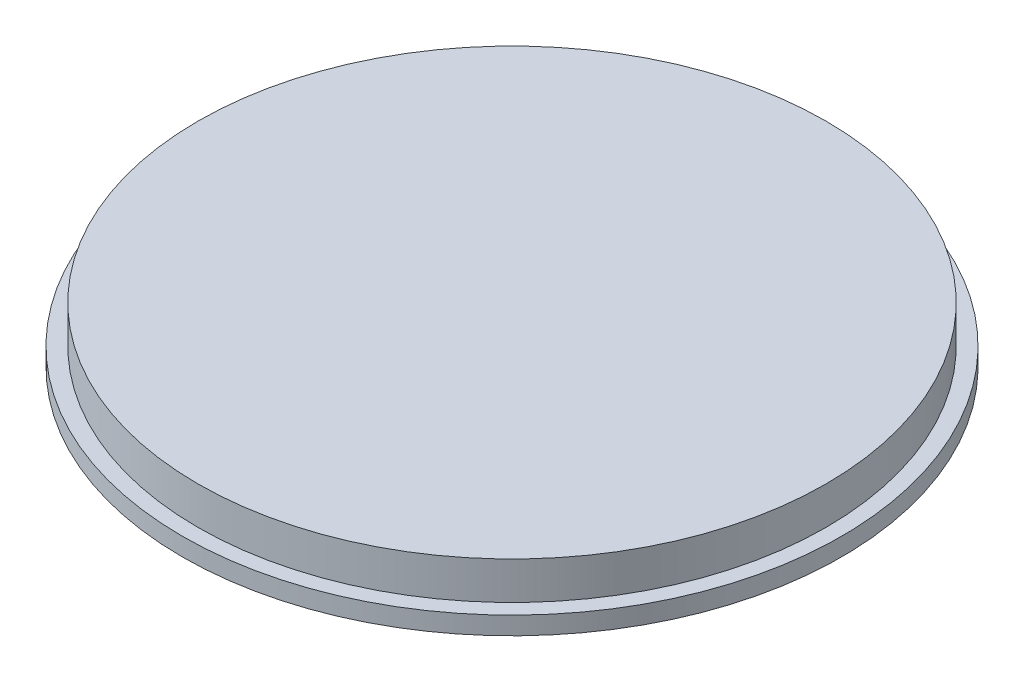
ISO-10303-21;
HEADER;
FILE_DESCRIPTION(('STEP AP214'),'2;1');
FILE_NAME('part.step','',(''),(''),'','','');
FILE_SCHEMA(('AUTOMOTIVE_DESIGN { 1 0 10303 214 1 1 1 1 }'));
ENDSEC;
DATA;
#1=APPLICATION_CONTEXT('core data for automotive mechanical design processes');
#2=APPLICATION_PROTOCOL_DEFINITION('international standard','automotive_design',2000,#1);
#3=PRODUCT_CONTEXT('',#1,'mechanical');
#4=PRODUCT('Part','Part','',(#3));
#5=PRODUCT_RELATED_PRODUCT_CATEGORY('part','',(#4));
#6=PRODUCT_DEFINITION_FORMATION('','',#4);
#7=PRODUCT_DEFINITION_CONTEXT('part definition',#1,'design');
#8=PRODUCT_DEFINITION('design','',#6,#7);
#9=PRODUCT_DEFINITION_SHAPE('','',#8);
#10=(LENGTH_UNIT() NAMED_UNIT(*) SI_UNIT(.MILLI.,.METRE.));
#11=(NAMED_UNIT(*) PLANE_ANGLE_UNIT() SI_UNIT($,.RADIAN.));
#12=(NAMED_UNIT(*) SI_UNIT($,.STERADIAN.) SOLID_ANGLE_UNIT());
#13=UNCERTAINTY_MEASURE_WITH_UNIT(LENGTH_MEASURE(1.E-05),#10,'distance_accuracy_value','');
#14=(GEOMETRIC_REPRESENTATION_CONTEXT(3) GLOBAL_UNCERTAINTY_ASSIGNED_CONTEXT((#13)) GLOBAL_UNIT_ASSIGNED_CONTEXT((#10,
#11,#12)) REPRESENTATION_CONTEXT('',''));
#15=CARTESIAN_POINT('',(0.,0.,0.));
#16=DIRECTION('',(0.,0.,1.));
#17=DIRECTION('',(1.,0.,0.));
#18=AXIS2_PLACEMENT_3D('',#15,#16,#17);
#19=CARTESIAN_POINT('',(0.,25.4,0.));
#20=DIRECTION('',(0.,1.,0.));
#21=DIRECTION('',(0.,0.,1.));
#22=AXIS2_PLACEMENT_3D('',#19,#20,#21);
#23=PLANE('',#22);
#24=CARTESIAN_POINT('',(0.,25.4,0.));
#25=DIRECTION('',(0.,1.,0.));
#26=DIRECTION('',(0.,0.,1.));
#27=AXIS2_PLACEMENT_3D('',#24,#25,#26);
#28=CIRCLE('',#27,466.344);
#29=CARTESIAN_POINT('',(0.,25.4,466.344));
#30=VERTEX_POINT('',#29);
#31=EDGE_CURVE('E10',#30,#30,#28,.T.);
#32=ORIENTED_EDGE('',*,*,#31,.T.);
#33=EDGE_LOOP('',(#32));
#34=FACE_BOUND('',#33,.T.);
#35=CARTESIAN_POINT('',(0.,25.4,0.));
#36=DIRECTION('',(0.,1.,0.));
#37=DIRECTION('',(0.,0.,1.));
#38=AXIS2_PLACEMENT_3D('',#35,#36,#37);
#39=CIRCLE('',#38,444.5);
#40=CARTESIAN_POINT('',(0.,25.4,444.5));
#41=VERTEX_POINT('',#40);
#42=EDGE_CURVE('E41',#41,#41,#39,.T.);
#43=ORIENTED_EDGE('',*,*,#42,.F.);
#44=EDGE_LOOP('',(#43));
#45=FACE_BOUND('',#44,.T.);
#46=ADVANCED_FACE('F28',(#34,#45),#23,.T.);
#47=CARTESIAN_POINT('',(0.,25.4,0.));
#48=DIRECTION('',(0.,-1.,0.));
#49=DIRECTION('',(0.,0.,-1.));
#50=AXIS2_PLACEMENT_3D('',#47,#48,#49);
#51=CYLINDRICAL_SURFACE('',#50,466.344);
#52=ORIENTED_EDGE('',*,*,#31,.F.);
#53=EDGE_LOOP('',(#52));
#54=FACE_BOUND('',#53,.T.);
#55=CARTESIAN_POINT('',(0.,0.,0.));
#56=DIRECTION('',(0.,1.,0.));
#57=DIRECTION('',(0.,0.,1.));
#58=AXIS2_PLACEMENT_3D('',#55,#56,#57);
#59=CIRCLE('',#58,466.344);
#60=CARTESIAN_POINT('',(0.,0.,466.344));
#61=VERTEX_POINT('',#60);
#62=EDGE_CURVE('E32',#61,#61,#59,.T.);
#63=ORIENTED_EDGE('',*,*,#62,.T.);
#64=EDGE_LOOP('',(#63));
#65=FACE_BOUND('',#64,.T.);
#66=ADVANCED_FACE('F30',(#54,#65),#51,.T.);
#67=CARTESIAN_POINT('',(0.,0.,0.));
#68=DIRECTION('',(0.,1.,0.));
#69=DIRECTION('',(0.,0.,1.));
#70=AXIS2_PLACEMENT_3D('',#67,#68,#69);
#71=PLANE('',#70);
#72=ORIENTED_EDGE('',*,*,#62,.F.);
#73=EDGE_LOOP('',(#72));
#74=FACE_BOUND('',#73,.T.);
#75=ADVANCED_FACE('F52',(#74),#71,.F.);
#76=CARTESIAN_POINT('',(0.,78.74,0.));
#77=DIRECTION('',(0.,-1.,0.));
#78=DIRECTION('',(0.,0.,-1.));
#79=AXIS2_PLACEMENT_3D('',#76,#77,#78);
#80=CYLINDRICAL_SURFACE('',#79,444.5);
#81=CARTESIAN_POINT('',(0.,78.74,0.));
#82=DIRECTION('',(0.,1.,0.));
#83=DIRECTION('',(0.,0.,1.));
#84=AXIS2_PLACEMENT_3D('',#81,#82,#83);
#85=CIRCLE('',#84,444.5);
#86=CARTESIAN_POINT('',(0.,78.74,444.5));
#87=VERTEX_POINT('',#86);
#88=EDGE_CURVE('E39',#87,#87,#85,.T.);
#89=ORIENTED_EDGE('',*,*,#88,.F.);
#90=EDGE_LOOP('',(#89));
#91=FACE_BOUND('',#90,.T.);
#92=ORIENTED_EDGE('',*,*,#42,.T.);
#93=EDGE_LOOP('',(#92));
#94=FACE_BOUND('',#93,.T.);
#95=ADVANCED_FACE('F49',(#91,#94),#80,.T.);
#96=CARTESIAN_POINT('',(0.,78.74,0.));
#97=DIRECTION('',(0.,1.,0.));
#98=DIRECTION('',(0.,0.,1.));
#99=AXIS2_PLACEMENT_3D('',#96,#97,#98);
#100=PLANE('',#99);
#101=ORIENTED_EDGE('',*,*,#88,.T.);
#102=EDGE_LOOP('',(#101));
#103=FACE_BOUND('',#102,.T.);
#104=ADVANCED_FACE('F47',(#103),#100,.T.);
#105=CLOSED_SHELL('',(#46,#66,#75,#95,#104));
#106=MANIFOLD_SOLID_BREP('B2',#105);
#107=ADVANCED_BREP_SHAPE_REPRESENTATION('',(#18,#106),#14);
#108=SHAPE_DEFINITION_REPRESENTATION(#9,#107);
ENDSEC;
END-ISO-10303-21;
